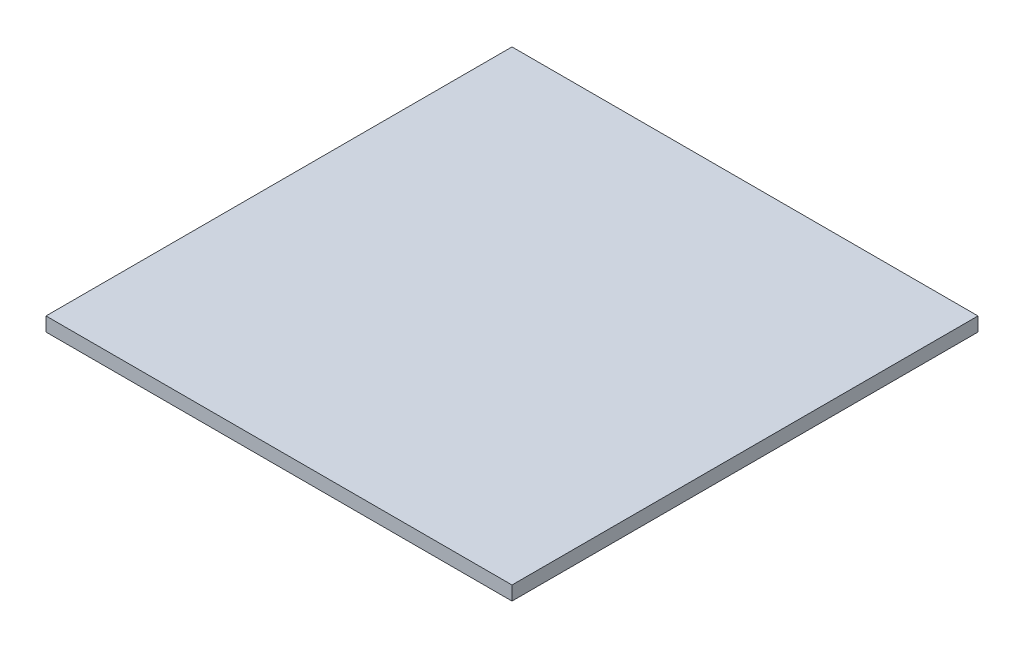
ISO-10303-21;
HEADER;
FILE_DESCRIPTION(('STEP AP214'),'2;1');
FILE_NAME('part.step','',(''),(''),'','','');
FILE_SCHEMA(('AUTOMOTIVE_DESIGN { 1 0 10303 214 1 1 1 1 }'));
ENDSEC;
DATA;
#1=APPLICATION_CONTEXT('core data for automotive mechanical design processes');
#2=APPLICATION_PROTOCOL_DEFINITION('international standard','automotive_design',2000,#1);
#3=PRODUCT_CONTEXT('',#1,'mechanical');
#4=PRODUCT('Part','Part','',(#3));
#5=PRODUCT_RELATED_PRODUCT_CATEGORY('part','',(#4));
#6=PRODUCT_DEFINITION_FORMATION('','',#4);
#7=PRODUCT_DEFINITION_CONTEXT('part definition',#1,'design');
#8=PRODUCT_DEFINITION('design','',#6,#7);
#9=PRODUCT_DEFINITION_SHAPE('','',#8);
#10=(LENGTH_UNIT() NAMED_UNIT(*) SI_UNIT(.MILLI.,.METRE.));
#11=(NAMED_UNIT(*) PLANE_ANGLE_UNIT() SI_UNIT($,.RADIAN.));
#12=(NAMED_UNIT(*) SI_UNIT($,.STERADIAN.) SOLID_ANGLE_UNIT());
#13=UNCERTAINTY_MEASURE_WITH_UNIT(LENGTH_MEASURE(1.E-05),#10,'distance_accuracy_value','');
#14=(GEOMETRIC_REPRESENTATION_CONTEXT(3) GLOBAL_UNCERTAINTY_ASSIGNED_CONTEXT((#13)) GLOBAL_UNIT_ASSIGNED_CONTEXT((#10,
#11,#12)) REPRESENTATION_CONTEXT('',''));
#15=CARTESIAN_POINT('',(0.,0.,0.));
#16=DIRECTION('',(0.,0.,1.));
#17=DIRECTION('',(1.,0.,0.));
#18=AXIS2_PLACEMENT_3D('',#15,#16,#17);
#19=CARTESIAN_POINT('',(0.,3.,0.));
#20=DIRECTION('',(1.,0.,0.));
#21=DIRECTION('',(0.,0.,-1.));
#22=AXIS2_PLACEMENT_3D('',#19,#20,#21);
#23=PLANE('',#22);
#24=DIRECTION('',(0.,0.,1.));
#25=VECTOR('',#24,1.);
#26=CARTESIAN_POINT('',(0.,0.,0.));
#27=LINE('',#26,#25);
#28=CARTESIAN_POINT('',(0.,0.,-100.));
#29=VERTEX_POINT('',#28);
#30=CARTESIAN_POINT('',(0.,0.,0.));
#31=VERTEX_POINT('',#30);
#32=EDGE_CURVE('E100',#29,#31,#27,.T.);
#33=ORIENTED_EDGE('',*,*,#32,.T.);
#34=DIRECTION('',(0.,-1.,0.));
#35=VECTOR('',#34,1.);
#36=CARTESIAN_POINT('',(0.,3.,0.));
#37=LINE('',#36,#35);
#38=CARTESIAN_POINT('',(0.,3.,0.));
#39=VERTEX_POINT('',#38);
#40=EDGE_CURVE('E11',#39,#31,#37,.T.);
#41=ORIENTED_EDGE('',*,*,#40,.F.);
#42=DIRECTION('',(0.,0.,1.));
#43=VECTOR('',#42,1.);
#44=CARTESIAN_POINT('',(0.,3.,0.));
#45=LINE('',#44,#43);
#46=CARTESIAN_POINT('',(0.,3.,-100.));
#47=VERTEX_POINT('',#46);
#48=EDGE_CURVE('E88',#47,#39,#45,.T.);
#49=ORIENTED_EDGE('',*,*,#48,.F.);
#50=DIRECTION('',(0.,-1.,0.));
#51=VECTOR('',#50,1.);
#52=CARTESIAN_POINT('',(0.,3.,-100.));
#53=LINE('',#52,#51);
#54=EDGE_CURVE('E96',#47,#29,#53,.T.);
#55=ORIENTED_EDGE('',*,*,#54,.T.);
#56=EDGE_LOOP('',(#33,#41,#49,#55));
#57=FACE_BOUND('',#56,.T.);
#58=ADVANCED_FACE('F37',(#57),#23,.F.);
#59=CARTESIAN_POINT('',(0.,3.,0.));
#60=DIRECTION('',(0.,0.,-1.));
#61=DIRECTION('',(-1.,0.,0.));
#62=AXIS2_PLACEMENT_3D('',#59,#60,#61);
#63=PLANE('',#62);
#64=DIRECTION('',(1.,0.,0.));
#65=VECTOR('',#64,1.);
#66=CARTESIAN_POINT('',(0.,0.,0.));
#67=LINE('',#66,#65);
#68=CARTESIAN_POINT('',(100.,0.,0.));
#69=VERTEX_POINT('',#68);
#70=EDGE_CURVE('E92',#31,#69,#67,.T.);
#71=ORIENTED_EDGE('',*,*,#70,.T.);
#72=DIRECTION('',(0.,-1.,0.));
#73=VECTOR('',#72,1.);
#74=CARTESIAN_POINT('',(100.,3.,0.));
#75=LINE('',#74,#73);
#76=CARTESIAN_POINT('',(100.,3.,0.));
#77=VERTEX_POINT('',#76);
#78=EDGE_CURVE('E45',#77,#69,#75,.T.);
#79=ORIENTED_EDGE('',*,*,#78,.F.);
#80=DIRECTION('',(1.,0.,0.));
#81=VECTOR('',#80,1.);
#82=CARTESIAN_POINT('',(0.,3.,0.));
#83=LINE('',#82,#81);
#84=EDGE_CURVE('E83',#39,#77,#83,.T.);
#85=ORIENTED_EDGE('',*,*,#84,.F.);
#86=ORIENTED_EDGE('',*,*,#40,.T.);
#87=EDGE_LOOP('',(#71,#79,#85,#86));
#88=FACE_BOUND('',#87,.T.);
#89=ADVANCED_FACE('F91',(#88),#63,.F.);
#90=CARTESIAN_POINT('',(100.,3.,0.));
#91=DIRECTION('',(-1.,0.,0.));
#92=DIRECTION('',(0.,0.,1.));
#93=AXIS2_PLACEMENT_3D('',#90,#91,#92);
#94=PLANE('',#93);
#95=DIRECTION('',(0.,0.,-1.));
#96=VECTOR('',#95,1.);
#97=CARTESIAN_POINT('',(100.,0.,0.));
#98=LINE('',#97,#96);
#99=CARTESIAN_POINT('',(100.,0.,-100.));
#100=VERTEX_POINT('',#99);
#101=EDGE_CURVE('E70',#69,#100,#98,.T.);
#102=ORIENTED_EDGE('',*,*,#101,.T.);
#103=DIRECTION('',(0.,-1.,0.));
#104=VECTOR('',#103,1.);
#105=CARTESIAN_POINT('',(100.,3.,-100.));
#106=LINE('',#105,#104);
#107=CARTESIAN_POINT('',(100.,3.,-100.));
#108=VERTEX_POINT('',#107);
#109=EDGE_CURVE('E93',#108,#100,#106,.T.);
#110=ORIENTED_EDGE('',*,*,#109,.F.);
#111=DIRECTION('',(0.,0.,-1.));
#112=VECTOR('',#111,1.);
#113=CARTESIAN_POINT('',(100.,3.,0.));
#114=LINE('',#113,#112);
#115=EDGE_CURVE('E86',#77,#108,#114,.T.);
#116=ORIENTED_EDGE('',*,*,#115,.F.);
#117=ORIENTED_EDGE('',*,*,#78,.T.);
#118=EDGE_LOOP('',(#102,#110,#116,#117));
#119=FACE_BOUND('',#118,.T.);
#120=ADVANCED_FACE('F94',(#119),#94,.F.);
#121=CARTESIAN_POINT('',(0.,3.,-100.));
#122=DIRECTION('',(0.,0.,1.));
#123=DIRECTION('',(1.,0.,0.));
#124=AXIS2_PLACEMENT_3D('',#121,#122,#123);
#125=PLANE('',#124);
#126=DIRECTION('',(-1.,0.,0.));
#127=VECTOR('',#126,1.);
#128=CARTESIAN_POINT('',(0.,0.,-100.));
#129=LINE('',#128,#127);
#130=EDGE_CURVE('E76',#100,#29,#129,.T.);
#131=ORIENTED_EDGE('',*,*,#130,.T.);
#132=ORIENTED_EDGE('',*,*,#54,.F.);
#133=DIRECTION('',(-1.,0.,0.));
#134=VECTOR('',#133,1.);
#135=CARTESIAN_POINT('',(0.,3.,-100.));
#136=LINE('',#135,#134);
#137=EDGE_CURVE('E53',#108,#47,#136,.T.);
#138=ORIENTED_EDGE('',*,*,#137,.F.);
#139=ORIENTED_EDGE('',*,*,#109,.T.);
#140=EDGE_LOOP('',(#131,#132,#138,#139));
#141=FACE_BOUND('',#140,.T.);
#142=ADVANCED_FACE('F107',(#141),#125,.F.);
#143=CARTESIAN_POINT('',(0.,3.,0.));
#144=DIRECTION('',(0.,-1.,0.));
#145=DIRECTION('',(0.,0.,-1.));
#146=AXIS2_PLACEMENT_3D('',#143,#144,#145);
#147=PLANE('',#146);
#148=ORIENTED_EDGE('',*,*,#48,.T.);
#149=ORIENTED_EDGE('',*,*,#84,.T.);
#150=ORIENTED_EDGE('',*,*,#115,.T.);
#151=ORIENTED_EDGE('',*,*,#137,.T.);
#152=EDGE_LOOP('',(#148,#149,#150,#151));
#153=FACE_BOUND('',#152,.T.);
#154=ADVANCED_FACE('F84',(#153),#147,.F.);
#155=CARTESIAN_POINT('',(0.,0.,0.));
#156=DIRECTION('',(0.,-1.,0.));
#157=DIRECTION('',(0.,0.,-1.));
#158=AXIS2_PLACEMENT_3D('',#155,#156,#157);
#159=PLANE('',#158);
#160=ORIENTED_EDGE('',*,*,#32,.F.);
#161=ORIENTED_EDGE('',*,*,#130,.F.);
#162=ORIENTED_EDGE('',*,*,#101,.F.);
#163=ORIENTED_EDGE('',*,*,#70,.F.);
#164=EDGE_LOOP('',(#160,#161,#162,#163));
#165=FACE_BOUND('',#164,.T.);
#166=ADVANCED_FACE('F110',(#165),#159,.T.);
#167=CLOSED_SHELL('',(#58,#89,#120,#142,#154,#166));
#168=MANIFOLD_SOLID_BREP('B2',#167);
#169=ADVANCED_BREP_SHAPE_REPRESENTATION('',(#18,#168),#14);
#170=SHAPE_DEFINITION_REPRESENTATION(#9,#169);
ENDSEC;
END-ISO-10303-21;
